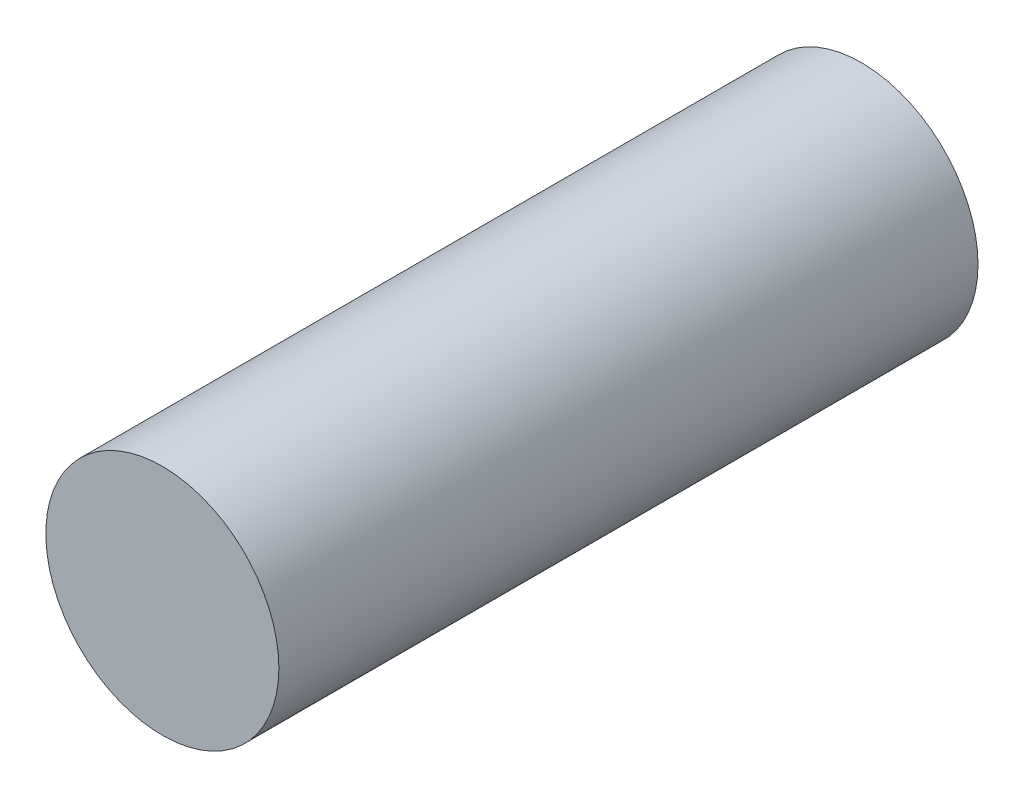
ISO-10303-21;
HEADER;
FILE_DESCRIPTION(('STEP AP214'),'2;1');
FILE_NAME('part.step','',(''),(''),'','','');
FILE_SCHEMA(('AUTOMOTIVE_DESIGN { 1 0 10303 214 1 1 1 1 }'));
ENDSEC;
DATA;
#1=APPLICATION_CONTEXT('core data for automotive mechanical design processes');
#2=APPLICATION_PROTOCOL_DEFINITION('international standard','automotive_design',2000,#1);
#3=PRODUCT_CONTEXT('',#1,'mechanical');
#4=PRODUCT('Part','Part','',(#3));
#5=PRODUCT_RELATED_PRODUCT_CATEGORY('part','',(#4));
#6=PRODUCT_DEFINITION_FORMATION('','',#4);
#7=PRODUCT_DEFINITION_CONTEXT('part definition',#1,'design');
#8=PRODUCT_DEFINITION('design','',#6,#7);
#9=PRODUCT_DEFINITION_SHAPE('','',#8);
#10=(LENGTH_UNIT() NAMED_UNIT(*) SI_UNIT(.MILLI.,.METRE.));
#11=(NAMED_UNIT(*) PLANE_ANGLE_UNIT() SI_UNIT($,.RADIAN.));
#12=(NAMED_UNIT(*) SI_UNIT($,.STERADIAN.) SOLID_ANGLE_UNIT());
#13=UNCERTAINTY_MEASURE_WITH_UNIT(LENGTH_MEASURE(1.E-05),#10,'distance_accuracy_value','');
#14=(GEOMETRIC_REPRESENTATION_CONTEXT(3) GLOBAL_UNCERTAINTY_ASSIGNED_CONTEXT((#13)) GLOBAL_UNIT_ASSIGNED_CONTEXT((#10,
#11,#12)) REPRESENTATION_CONTEXT('',''));
#15=CARTESIAN_POINT('',(0.,0.,0.));
#16=DIRECTION('',(0.,0.,1.));
#17=DIRECTION('',(1.,0.,0.));
#18=AXIS2_PLACEMENT_3D('',#15,#16,#17);
#19=CARTESIAN_POINT('',(0.,0.,152.4));
#20=DIRECTION('',(0.,0.,-1.));
#21=DIRECTION('',(-1.,0.,0.));
#22=AXIS2_PLACEMENT_3D('',#19,#20,#21);
#23=CYLINDRICAL_SURFACE('',#22,25.4);
#24=CARTESIAN_POINT('',(0.,0.,152.4));
#25=DIRECTION('',(0.,0.,1.));
#26=DIRECTION('',(1.,0.,0.));
#27=AXIS2_PLACEMENT_3D('',#24,#25,#26);
#28=CIRCLE('',#27,25.4);
#29=CARTESIAN_POINT('',(25.4,0.,152.4));
#30=VERTEX_POINT('',#29);
#31=EDGE_CURVE('E10',#30,#30,#28,.T.);
#32=ORIENTED_EDGE('',*,*,#31,.F.);
#33=EDGE_LOOP('',(#32));
#34=FACE_BOUND('',#33,.T.);
#35=CARTESIAN_POINT('',(0.,0.,0.));
#36=DIRECTION('',(0.,0.,1.));
#37=DIRECTION('',(1.,0.,0.));
#38=AXIS2_PLACEMENT_3D('',#35,#36,#37);
#39=CIRCLE('',#38,25.4);
#40=CARTESIAN_POINT('',(25.4,0.,0.));
#41=VERTEX_POINT('',#40);
#42=EDGE_CURVE('E40',#41,#41,#39,.T.);
#43=ORIENTED_EDGE('',*,*,#42,.T.);
#44=EDGE_LOOP('',(#43));
#45=FACE_BOUND('',#44,.T.);
#46=ADVANCED_FACE('F37',(#34,#45),#23,.T.);
#47=CARTESIAN_POINT('',(0.,0.,152.4));
#48=DIRECTION('',(0.,0.,1.));
#49=DIRECTION('',(1.,0.,0.));
#50=AXIS2_PLACEMENT_3D('',#47,#48,#49);
#51=PLANE('',#50);
#52=ORIENTED_EDGE('',*,*,#31,.T.);
#53=EDGE_LOOP('',(#52));
#54=FACE_BOUND('',#53,.T.);
#55=ADVANCED_FACE('F52',(#54),#51,.T.);
#56=CARTESIAN_POINT('',(0.,0.,0.));
#57=DIRECTION('',(0.,0.,1.));
#58=DIRECTION('',(1.,0.,0.));
#59=AXIS2_PLACEMENT_3D('',#56,#57,#58);
#60=PLANE('',#59);
#61=ORIENTED_EDGE('',*,*,#42,.F.);
#62=EDGE_LOOP('',(#61));
#63=FACE_BOUND('',#62,.T.);
#64=ADVANCED_FACE('F50',(#63),#60,.F.);
#65=CLOSED_SHELL('',(#46,#55,#64));
#66=MANIFOLD_SOLID_BREP('B2',#65);
#67=ADVANCED_BREP_SHAPE_REPRESENTATION('',(#18,#66),#14);
#68=SHAPE_DEFINITION_REPRESENTATION(#9,#67);
ENDSEC;
END-ISO-10303-21;
